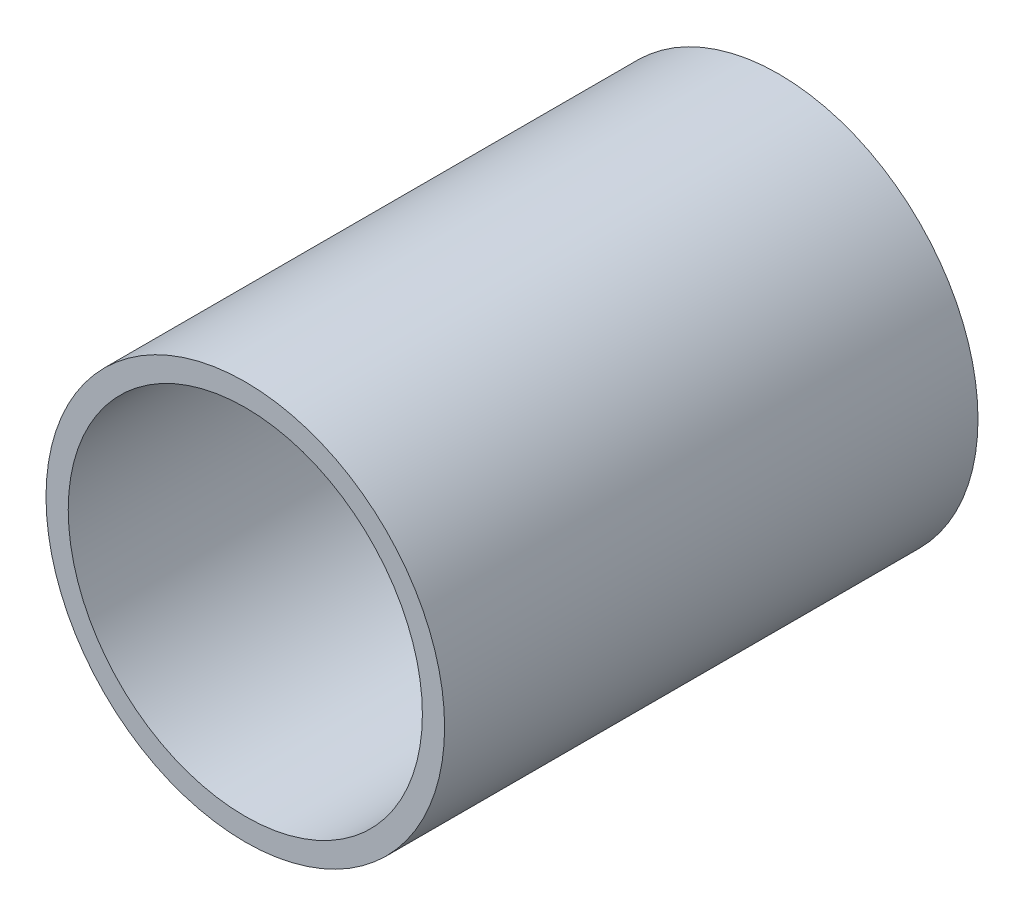
ISO-10303-21;
HEADER;
FILE_DESCRIPTION(('STEP AP214'),'2;1');
FILE_NAME('part.step','',(''),(''),'','','');
FILE_SCHEMA(('AUTOMOTIVE_DESIGN { 1 0 10303 214 1 1 1 1 }'));
ENDSEC;
DATA;
#1=APPLICATION_CONTEXT('core data for automotive mechanical design processes');
#2=APPLICATION_PROTOCOL_DEFINITION('international standard','automotive_design',2000,#1);
#3=PRODUCT_CONTEXT('',#1,'mechanical');
#4=PRODUCT('Part','Part','',(#3));
#5=PRODUCT_RELATED_PRODUCT_CATEGORY('part','',(#4));
#6=PRODUCT_DEFINITION_FORMATION('','',#4);
#7=PRODUCT_DEFINITION_CONTEXT('part definition',#1,'design');
#8=PRODUCT_DEFINITION('design','',#6,#7);
#9=PRODUCT_DEFINITION_SHAPE('','',#8);
#10=(LENGTH_UNIT() NAMED_UNIT(*) SI_UNIT(.MILLI.,.METRE.));
#11=(NAMED_UNIT(*) PLANE_ANGLE_UNIT() SI_UNIT($,.RADIAN.));
#12=(NAMED_UNIT(*) SI_UNIT($,.STERADIAN.) SOLID_ANGLE_UNIT());
#13=UNCERTAINTY_MEASURE_WITH_UNIT(LENGTH_MEASURE(1.E-05),#10,'distance_accuracy_value','');
#14=(GEOMETRIC_REPRESENTATION_CONTEXT(3) GLOBAL_UNCERTAINTY_ASSIGNED_CONTEXT((#13)) GLOBAL_UNIT_ASSIGNED_CONTEXT((#10,
#11,#12)) REPRESENTATION_CONTEXT('',''));
#15=CARTESIAN_POINT('',(0.,0.,0.));
#16=DIRECTION('',(0.,0.,1.));
#17=DIRECTION('',(1.,0.,0.));
#18=AXIS2_PLACEMENT_3D('',#15,#16,#17);
#19=CARTESIAN_POINT('',(0.,0.,152.4));
#20=DIRECTION('',(0.,0.,1.));
#21=DIRECTION('',(1.,0.,0.));
#22=AXIS2_PLACEMENT_3D('',#19,#20,#21);
#23=PLANE('',#22);
#24=CARTESIAN_POINT('',(0.,0.,152.4));
#25=DIRECTION('',(0.,0.,1.));
#26=DIRECTION('',(1.,0.,0.));
#27=AXIS2_PLACEMENT_3D('',#24,#25,#26);
#28=CIRCLE('',#27,56.945);
#29=CARTESIAN_POINT('',(56.945,0.,152.4));
#30=VERTEX_POINT('',#29);
#31=EDGE_CURVE('E10',#30,#30,#28,.T.);
#32=ORIENTED_EDGE('',*,*,#31,.T.);
#33=EDGE_LOOP('',(#32));
#34=FACE_BOUND('',#33,.T.);
#35=CARTESIAN_POINT('',(0.,0.,152.4));
#36=DIRECTION('',(0.,0.,1.));
#37=DIRECTION('',(1.,0.,0.));
#38=AXIS2_PLACEMENT_3D('',#35,#36,#37);
#39=CIRCLE('',#38,50.5949999999999);
#40=CARTESIAN_POINT('',(50.5949999999999,0.,152.4));
#41=VERTEX_POINT('',#40);
#42=EDGE_CURVE('E45',#41,#41,#39,.T.);
#43=ORIENTED_EDGE('',*,*,#42,.F.);
#44=EDGE_LOOP('',(#43));
#45=FACE_BOUND('',#44,.T.);
#46=ADVANCED_FACE('F34',(#34,#45),#23,.T.);
#47=CARTESIAN_POINT('',(0.,0.,0.));
#48=DIRECTION('',(0.,0.,1.));
#49=DIRECTION('',(1.,0.,0.));
#50=AXIS2_PLACEMENT_3D('',#47,#48,#49);
#51=PLANE('',#50);
#52=CARTESIAN_POINT('',(0.,0.,0.));
#53=DIRECTION('',(0.,0.,1.));
#54=DIRECTION('',(1.,0.,0.));
#55=AXIS2_PLACEMENT_3D('',#52,#53,#54);
#56=CIRCLE('',#55,56.945);
#57=CARTESIAN_POINT('',(56.945,0.,0.));
#58=VERTEX_POINT('',#57);
#59=EDGE_CURVE('E38',#58,#58,#56,.T.);
#60=ORIENTED_EDGE('',*,*,#59,.F.);
#61=EDGE_LOOP('',(#60));
#62=FACE_BOUND('',#61,.T.);
#63=CARTESIAN_POINT('',(0.,0.,0.));
#64=DIRECTION('',(0.,0.,1.));
#65=DIRECTION('',(1.,0.,0.));
#66=AXIS2_PLACEMENT_3D('',#63,#64,#65);
#67=CIRCLE('',#66,50.5949999999999);
#68=CARTESIAN_POINT('',(50.5949999999999,0.,0.));
#69=VERTEX_POINT('',#68);
#70=EDGE_CURVE('E47',#69,#69,#67,.T.);
#71=ORIENTED_EDGE('',*,*,#70,.T.);
#72=EDGE_LOOP('',(#71));
#73=FACE_BOUND('',#72,.T.);
#74=ADVANCED_FACE('F57',(#62,#73),#51,.F.);
#75=CARTESIAN_POINT('',(0.,0.,152.4));
#76=DIRECTION('',(0.,0.,-1.));
#77=DIRECTION('',(-1.,0.,0.));
#78=AXIS2_PLACEMENT_3D('',#75,#76,#77);
#79=CYLINDRICAL_SURFACE('',#78,56.945);
#80=ORIENTED_EDGE('',*,*,#31,.F.);
#81=EDGE_LOOP('',(#80));
#82=FACE_BOUND('',#81,.T.);
#83=ORIENTED_EDGE('',*,*,#59,.T.);
#84=EDGE_LOOP('',(#83));
#85=FACE_BOUND('',#84,.T.);
#86=ADVANCED_FACE('F36',(#82,#85),#79,.T.);
#87=CARTESIAN_POINT('',(0.,0.,152.4));
#88=DIRECTION('',(0.,0.,-1.));
#89=DIRECTION('',(-1.,0.,0.));
#90=AXIS2_PLACEMENT_3D('',#87,#88,#89);
#91=CYLINDRICAL_SURFACE('',#90,50.5949999999999);
#92=ORIENTED_EDGE('',*,*,#42,.T.);
#93=EDGE_LOOP('',(#92));
#94=FACE_BOUND('',#93,.T.);
#95=ORIENTED_EDGE('',*,*,#70,.F.);
#96=EDGE_LOOP('',(#95));
#97=FACE_BOUND('',#96,.T.);
#98=ADVANCED_FACE('F53',(#94,#97),#91,.F.);
#99=CLOSED_SHELL('',(#46,#74,#86,#98));
#100=MANIFOLD_SOLID_BREP('B2',#99);
#101=ADVANCED_BREP_SHAPE_REPRESENTATION('',(#18,#100),#14);
#102=SHAPE_DEFINITION_REPRESENTATION(#9,#101);
ENDSEC;
END-ISO-10303-21;
